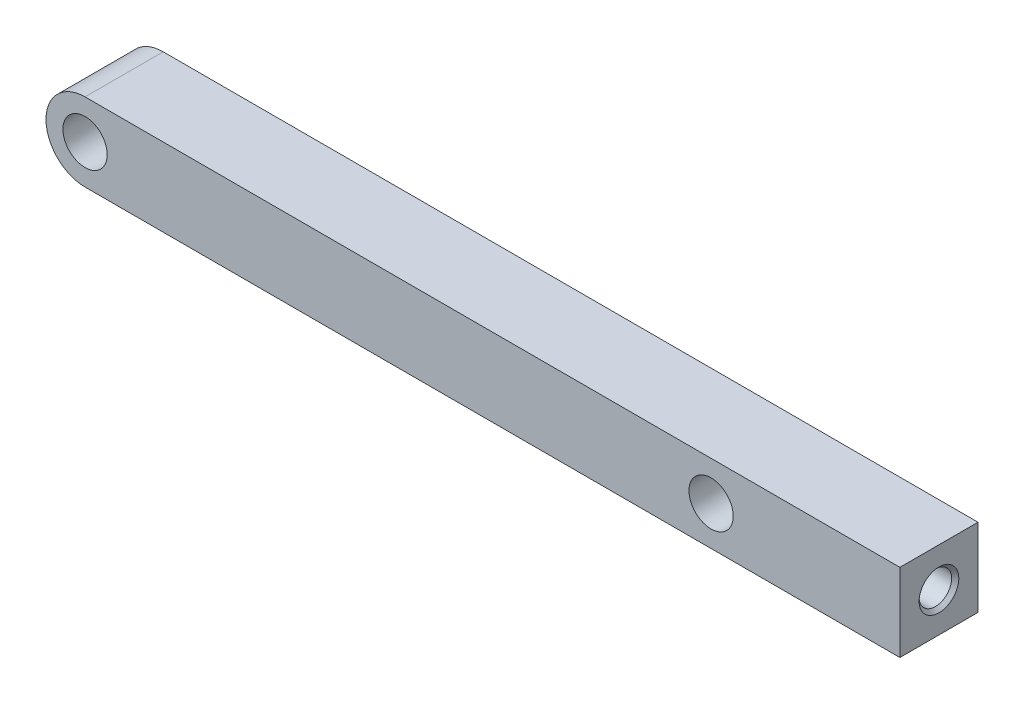
ISO-10303-21;
HEADER;
FILE_DESCRIPTION(('STEP AP214'),'2;1');
FILE_NAME('part.step','',(''),(''),'','','');
FILE_SCHEMA(('AUTOMOTIVE_DESIGN { 1 0 10303 214 1 1 1 1 }'));
ENDSEC;
DATA;
#1=APPLICATION_CONTEXT('core data for automotive mechanical design processes');
#2=APPLICATION_PROTOCOL_DEFINITION('international standard','automotive_design',2000,#1);
#3=PRODUCT_CONTEXT('',#1,'mechanical');
#4=PRODUCT('Part','Part','',(#3));
#5=PRODUCT_RELATED_PRODUCT_CATEGORY('part','',(#4));
#6=PRODUCT_DEFINITION_FORMATION('','',#4);
#7=PRODUCT_DEFINITION_CONTEXT('part definition',#1,'design');
#8=PRODUCT_DEFINITION('design','',#6,#7);
#9=PRODUCT_DEFINITION_SHAPE('','',#8);
#10=(LENGTH_UNIT() NAMED_UNIT(*) SI_UNIT(.MILLI.,.METRE.));
#11=(NAMED_UNIT(*) PLANE_ANGLE_UNIT() SI_UNIT($,.RADIAN.));
#12=(NAMED_UNIT(*) SI_UNIT($,.STERADIAN.) SOLID_ANGLE_UNIT());
#13=UNCERTAINTY_MEASURE_WITH_UNIT(LENGTH_MEASURE(1.E-05),#10,'distance_accuracy_value','');
#14=(GEOMETRIC_REPRESENTATION_CONTEXT(3) GLOBAL_UNCERTAINTY_ASSIGNED_CONTEXT((#13)) GLOBAL_UNIT_ASSIGNED_CONTEXT((#10,
#11,#12)) REPRESENTATION_CONTEXT('',''));
#15=CARTESIAN_POINT('',(0.,0.,0.));
#16=DIRECTION('',(0.,0.,1.));
#17=DIRECTION('',(1.,0.,0.));
#18=AXIS2_PLACEMENT_3D('',#15,#16,#17);
#19=CARTESIAN_POINT('',(0.,27.0416305603428,3.));
#20=DIRECTION('',(0.,-1.,0.));
#21=DIRECTION('',(1.,0.,0.));
#22=AXIS2_PLACEMENT_3D('',#19,#20,#21);
#23=PLANE('',#22);
#24=DIRECTION('',(-1.,0.,0.));
#25=VECTOR('',#24,1.);
#26=CARTESIAN_POINT('',(0.,27.0416305603428,-3.));
#27=LINE('',#26,#25);
#28=CARTESIAN_POINT('',(38.5416305603425,27.0416305603428,-3.));
#29=VERTEX_POINT('',#28);
#30=CARTESIAN_POINT('',(-24.0416305603425,27.0416305603427,-3.));
#31=VERTEX_POINT('',#30);
#32=EDGE_CURVE('E108',#29,#31,#27,.T.);
#33=ORIENTED_EDGE('',*,*,#32,.T.);
#34=DIRECTION('',(0.,0.,-1.));
#35=VECTOR('',#34,1.);
#36=CARTESIAN_POINT('',(-24.0416305603425,27.0416305603427,3.));
#37=LINE('',#36,#35);
#38=CARTESIAN_POINT('',(-24.0416305603425,27.0416305603427,3.));
#39=VERTEX_POINT('',#38);
#40=EDGE_CURVE('E11',#39,#31,#37,.T.);
#41=ORIENTED_EDGE('',*,*,#40,.F.);
#42=DIRECTION('',(-1.,0.,0.));
#43=VECTOR('',#42,1.);
#44=CARTESIAN_POINT('',(0.,27.0416305603428,3.));
#45=LINE('',#44,#43);
#46=CARTESIAN_POINT('',(38.5416305603425,27.0416305603428,3.));
#47=VERTEX_POINT('',#46);
#48=EDGE_CURVE('E119',#47,#39,#45,.T.);
#49=ORIENTED_EDGE('',*,*,#48,.F.);
#50=DIRECTION('',(0.,0.,-1.));
#51=VECTOR('',#50,1.);
#52=CARTESIAN_POINT('',(38.5416305603425,27.0416305603428,3.));
#53=LINE('',#52,#51);
#54=EDGE_CURVE('E131',#47,#29,#53,.T.);
#55=ORIENTED_EDGE('',*,*,#54,.T.);
#56=EDGE_LOOP('',(#33,#41,#49,#55));
#57=FACE_BOUND('',#56,.T.);
#58=ADVANCED_FACE('F47',(#57),#23,.F.);
#59=CARTESIAN_POINT('',(-24.0416305603425,24.0416305603427,3.));
#60=DIRECTION('',(0.,0.,-1.));
#61=DIRECTION('',(-1.,0.,0.));
#62=AXIS2_PLACEMENT_3D('',#59,#60,#61);
#63=CYLINDRICAL_SURFACE('',#62,3.);
#64=CARTESIAN_POINT('',(-24.0416305603425,24.0416305603427,-3.));
#65=DIRECTION('',(0.,0.,1.));
#66=DIRECTION('',(1.,0.,0.));
#67=AXIS2_PLACEMENT_3D('',#64,#65,#66);
#68=CIRCLE('',#67,3.);
#69=CARTESIAN_POINT('',(-24.0416305603425,21.0416305603427,-3.));
#70=VERTEX_POINT('',#69);
#71=EDGE_CURVE('E112',#31,#70,#68,.T.);
#72=ORIENTED_EDGE('',*,*,#71,.T.);
#73=DIRECTION('',(0.,0.,-1.));
#74=VECTOR('',#73,1.);
#75=CARTESIAN_POINT('',(-24.0416305603425,21.0416305603427,3.));
#76=LINE('',#75,#74);
#77=CARTESIAN_POINT('',(-24.0416305603425,21.0416305603427,3.));
#78=VERTEX_POINT('',#77);
#79=EDGE_CURVE('E55',#78,#70,#76,.T.);
#80=ORIENTED_EDGE('',*,*,#79,.F.);
#81=CARTESIAN_POINT('',(-24.0416305603425,24.0416305603427,3.));
#82=DIRECTION('',(0.,0.,1.));
#83=DIRECTION('',(1.,0.,0.));
#84=AXIS2_PLACEMENT_3D('',#81,#82,#83);
#85=CIRCLE('',#84,3.);
#86=EDGE_CURVE('E94',#39,#78,#85,.T.);
#87=ORIENTED_EDGE('',*,*,#86,.F.);
#88=ORIENTED_EDGE('',*,*,#40,.T.);
#89=EDGE_LOOP('',(#72,#80,#87,#88));
#90=FACE_BOUND('',#89,.T.);
#91=ADVANCED_FACE('F169',(#90),#63,.T.);
#92=CARTESIAN_POINT('',(0.,21.0416305603428,3.));
#93=DIRECTION('',(0.,1.,0.));
#94=DIRECTION('',(-1.,0.,0.));
#95=AXIS2_PLACEMENT_3D('',#92,#93,#94);
#96=PLANE('',#95);
#97=DIRECTION('',(1.,0.,0.));
#98=VECTOR('',#97,1.);
#99=CARTESIAN_POINT('',(0.,21.0416305603428,-3.));
#100=LINE('',#99,#98);
#101=CARTESIAN_POINT('',(38.5416305603425,21.0416305603428,-3.));
#102=VERTEX_POINT('',#101);
#103=EDGE_CURVE('E81',#70,#102,#100,.T.);
#104=ORIENTED_EDGE('',*,*,#103,.T.);
#105=DIRECTION('',(0.,0.,-1.));
#106=VECTOR('',#105,1.);
#107=CARTESIAN_POINT('',(38.5416305603425,21.0416305603428,3.));
#108=LINE('',#107,#106);
#109=CARTESIAN_POINT('',(38.5416305603425,21.0416305603428,3.));
#110=VERTEX_POINT('',#109);
#111=EDGE_CURVE('E142',#110,#102,#108,.T.);
#112=ORIENTED_EDGE('',*,*,#111,.F.);
#113=DIRECTION('',(1.,0.,0.));
#114=VECTOR('',#113,1.);
#115=CARTESIAN_POINT('',(0.,21.0416305603428,3.));
#116=LINE('',#115,#114);
#117=EDGE_CURVE('E123',#78,#110,#116,.T.);
#118=ORIENTED_EDGE('',*,*,#117,.F.);
#119=ORIENTED_EDGE('',*,*,#79,.T.);
#120=EDGE_LOOP('',(#104,#112,#118,#119));
#121=FACE_BOUND('',#120,.T.);
#122=ADVANCED_FACE('F144',(#121),#96,.F.);
#123=CARTESIAN_POINT('',(24.0416305603425,24.0416305603427,3.));
#124=DIRECTION('',(0.,0.,-1.));
#125=DIRECTION('',(-1.,0.,0.));
#126=AXIS2_PLACEMENT_3D('',#123,#124,#125);
#127=CYLINDRICAL_SURFACE('',#126,1.69999999999998);
#128=CARTESIAN_POINT('',(24.0416305603425,24.0416305603427,3.));
#129=DIRECTION('',(0.,0.,1.));
#130=DIRECTION('',(1.,0.,0.));
#131=AXIS2_PLACEMENT_3D('',#128,#129,#130);
#132=CIRCLE('',#131,1.69999999999998);
#133=CARTESIAN_POINT('',(25.7416305603425,24.0416305603427,3.));
#134=VERTEX_POINT('',#133);
#135=EDGE_CURVE('E126',#134,#134,#132,.T.);
#136=ORIENTED_EDGE('',*,*,#135,.T.);
#137=EDGE_LOOP('',(#136));
#138=FACE_BOUND('',#137,.T.);
#139=CARTESIAN_POINT('',(24.0416305603425,24.0416305603427,-3.));
#140=DIRECTION('',(0.,0.,1.));
#141=DIRECTION('',(1.,0.,0.));
#142=AXIS2_PLACEMENT_3D('',#139,#140,#141);
#143=CIRCLE('',#142,1.69999999999998);
#144=CARTESIAN_POINT('',(25.7416305603425,24.0416305603427,-3.));
#145=VERTEX_POINT('',#144);
#146=EDGE_CURVE('E136',#145,#145,#143,.T.);
#147=ORIENTED_EDGE('',*,*,#146,.F.);
#148=EDGE_LOOP('',(#147));
#149=FACE_BOUND('',#148,.T.);
#150=ADVANCED_FACE('F154',(#138,#149),#127,.F.);
#151=CARTESIAN_POINT('',(38.5416305603425,0.,3.));
#152=DIRECTION('',(-1.,0.,0.));
#153=DIRECTION('',(0.,0.,1.));
#154=AXIS2_PLACEMENT_3D('',#151,#152,#153);
#155=PLANE('',#154);
#156=CARTESIAN_POINT('',(38.5416305603425,24.0416305603428,0.));
#157=DIRECTION('',(1.,0.,0.));
#158=DIRECTION('',(0.,0.,-1.));
#159=AXIS2_PLACEMENT_3D('',#156,#157,#158);
#160=CIRCLE('',#159,1.525);
#161=CARTESIAN_POINT('',(38.5416305603425,24.0416305603428,-1.525));
#162=VERTEX_POINT('',#161);
#163=EDGE_CURVE('E115',#162,#162,#160,.T.);
#164=ORIENTED_EDGE('',*,*,#163,.F.);
#165=EDGE_LOOP('',(#164));
#166=FACE_BOUND('',#165,.T.);
#167=DIRECTION('',(0.,1.,0.));
#168=VECTOR('',#167,1.);
#169=CARTESIAN_POINT('',(38.5416305603425,0.,-3.));
#170=LINE('',#169,#168);
#171=EDGE_CURVE('E87',#102,#29,#170,.T.);
#172=ORIENTED_EDGE('',*,*,#171,.T.);
#173=ORIENTED_EDGE('',*,*,#54,.F.);
#174=DIRECTION('',(0.,1.,0.));
#175=VECTOR('',#174,1.);
#176=CARTESIAN_POINT('',(38.5416305603425,0.,3.));
#177=LINE('',#176,#175);
#178=EDGE_CURVE('E63',#110,#47,#177,.T.);
#179=ORIENTED_EDGE('',*,*,#178,.F.);
#180=ORIENTED_EDGE('',*,*,#111,.T.);
#181=EDGE_LOOP('',(#172,#173,#179,#180));
#182=FACE_BOUND('',#181,.T.);
#183=ADVANCED_FACE('F151',(#166,#182),#155,.F.);
#184=CARTESIAN_POINT('',(-24.0416305603425,24.0416305603427,3.));
#185=DIRECTION('',(0.,0.,-1.));
#186=DIRECTION('',(-1.,0.,0.));
#187=AXIS2_PLACEMENT_3D('',#184,#185,#186);
#188=CYLINDRICAL_SURFACE('',#187,1.69999999999999);
#189=CARTESIAN_POINT('',(-24.0416305603425,24.0416305603427,3.));
#190=DIRECTION('',(0.,0.,1.));
#191=DIRECTION('',(1.,0.,0.));
#192=AXIS2_PLACEMENT_3D('',#189,#190,#191);
#193=CIRCLE('',#192,1.69999999999999);
#194=CARTESIAN_POINT('',(-22.3416305603425,24.0416305603427,3.));
#195=VERTEX_POINT('',#194);
#196=EDGE_CURVE('E129',#195,#195,#193,.T.);
#197=ORIENTED_EDGE('',*,*,#196,.T.);
#198=EDGE_LOOP('',(#197));
#199=FACE_BOUND('',#198,.T.);
#200=CARTESIAN_POINT('',(-24.0416305603425,24.0416305603427,-3.));
#201=DIRECTION('',(0.,0.,1.));
#202=DIRECTION('',(1.,0.,0.));
#203=AXIS2_PLACEMENT_3D('',#200,#201,#202);
#204=CIRCLE('',#203,1.69999999999999);
#205=CARTESIAN_POINT('',(-22.3416305603425,24.0416305603427,-3.));
#206=VERTEX_POINT('',#205);
#207=EDGE_CURVE('E121',#206,#206,#204,.T.);
#208=ORIENTED_EDGE('',*,*,#207,.F.);
#209=EDGE_LOOP('',(#208));
#210=FACE_BOUND('',#209,.T.);
#211=ADVANCED_FACE('F153',(#199,#210),#188,.F.);
#212=CARTESIAN_POINT('',(0.,0.,3.));
#213=DIRECTION('',(0.,0.,1.));
#214=DIRECTION('',(1.,0.,0.));
#215=AXIS2_PLACEMENT_3D('',#212,#213,#214);
#216=PLANE('',#215);
#217=ORIENTED_EDGE('',*,*,#48,.T.);
#218=ORIENTED_EDGE('',*,*,#86,.T.);
#219=ORIENTED_EDGE('',*,*,#117,.T.);
#220=ORIENTED_EDGE('',*,*,#178,.T.);
#221=EDGE_LOOP('',(#217,#218,#219,#220));
#222=FACE_BOUND('',#221,.T.);
#223=ORIENTED_EDGE('',*,*,#135,.F.);
#224=EDGE_LOOP('',(#223));
#225=FACE_BOUND('',#224,.T.);
#226=ORIENTED_EDGE('',*,*,#196,.F.);
#227=EDGE_LOOP('',(#226));
#228=FACE_BOUND('',#227,.T.);
#229=ADVANCED_FACE('F161',(#222,#225,#228),#216,.T.);
#230=CARTESIAN_POINT('',(0.,0.,-3.));
#231=DIRECTION('',(0.,0.,1.));
#232=DIRECTION('',(1.,0.,0.));
#233=AXIS2_PLACEMENT_3D('',#230,#231,#232);
#234=PLANE('',#233);
#235=ORIENTED_EDGE('',*,*,#32,.F.);
#236=ORIENTED_EDGE('',*,*,#171,.F.);
#237=ORIENTED_EDGE('',*,*,#103,.F.);
#238=ORIENTED_EDGE('',*,*,#71,.F.);
#239=EDGE_LOOP('',(#235,#236,#237,#238));
#240=FACE_BOUND('',#239,.T.);
#241=ORIENTED_EDGE('',*,*,#146,.T.);
#242=EDGE_LOOP('',(#241));
#243=FACE_BOUND('',#242,.T.);
#244=ORIENTED_EDGE('',*,*,#207,.T.);
#245=EDGE_LOOP('',(#244));
#246=FACE_BOUND('',#245,.T.);
#247=ADVANCED_FACE('F102',(#240,#243,#246),#234,.F.);
#248=CARTESIAN_POINT('',(31.7927063341269,24.0416305603428,0.));
#249=DIRECTION('',(1.,0.,0.));
#250=DIRECTION('',(0.,0.,-1.));
#251=AXIS2_PLACEMENT_3D('',#248,#249,#250);
#252=CONICAL_SURFACE('',#251,1.25,1.02974425867665);
#253=CARTESIAN_POINT('',(31.0416305603425,24.0416305603428,0.));
#254=VERTEX_POINT('',#253);
#255=VERTEX_LOOP('',#254);
#256=FACE_BOUND('',#255,.T.);
#257=CARTESIAN_POINT('',(31.7927063341269,24.0416305603428,0.));
#258=DIRECTION('',(1.,0.,0.));
#259=DIRECTION('',(0.,0.,-1.));
#260=AXIS2_PLACEMENT_3D('',#257,#258,#259);
#261=CIRCLE('',#260,1.25);
#262=CARTESIAN_POINT('',(31.7927063341269,24.0416305603428,-1.25));
#263=VERTEX_POINT('',#262);
#264=EDGE_CURVE('E106',#263,#263,#261,.T.);
#265=ORIENTED_EDGE('',*,*,#264,.T.);
#266=EDGE_LOOP('',(#265));
#267=FACE_BOUND('',#266,.T.);
#268=ADVANCED_FACE('F98',(#256,#267),#252,.F.);
#269=CARTESIAN_POINT('',(38.5416305603425,24.0416305603428,0.));
#270=DIRECTION('',(1.,0.,0.));
#271=DIRECTION('',(0.,0.,-1.));
#272=AXIS2_PLACEMENT_3D('',#269,#270,#271);
#273=CYLINDRICAL_SURFACE('',#272,1.24999999999999);
#274=ORIENTED_EDGE('',*,*,#264,.F.);
#275=EDGE_LOOP('',(#274));
#276=FACE_BOUND('',#275,.T.);
#277=CARTESIAN_POINT('',(38.2666305603425,24.0416305603428,0.));
#278=DIRECTION('',(1.,0.,0.));
#279=DIRECTION('',(0.,0.,-1.));
#280=AXIS2_PLACEMENT_3D('',#277,#278,#279);
#281=CIRCLE('',#280,1.24999999999999);
#282=CARTESIAN_POINT('',(38.2666305603425,24.0416305603428,-1.24999999999999));
#283=VERTEX_POINT('',#282);
#284=EDGE_CURVE('E109',#283,#283,#281,.T.);
#285=ORIENTED_EDGE('',*,*,#284,.T.);
#286=EDGE_LOOP('',(#285));
#287=FACE_BOUND('',#286,.T.);
#288=ADVANCED_FACE('F101',(#276,#287),#273,.F.);
#289=CARTESIAN_POINT('',(38.5416305603425,24.0416305603428,0.));
#290=DIRECTION('',(1.,0.,0.));
#291=DIRECTION('',(0.,0.,-1.));
#292=AXIS2_PLACEMENT_3D('',#289,#290,#291);
#293=CONICAL_SURFACE('',#292,1.525,0.785398163397474);
#294=ORIENTED_EDGE('',*,*,#284,.F.);
#295=EDGE_LOOP('',(#294));
#296=FACE_BOUND('',#295,.T.);
#297=ORIENTED_EDGE('',*,*,#163,.T.);
#298=EDGE_LOOP('',(#297));
#299=FACE_BOUND('',#298,.T.);
#300=ADVANCED_FACE('F235',(#296,#299),#293,.F.);
#301=CLOSED_SHELL('',(#58,#91,#122,#150,#183,#211,#229,#247,#268,#288,#300));
#302=MANIFOLD_SOLID_BREP('B2',#301);
#303=ADVANCED_BREP_SHAPE_REPRESENTATION('',(#18,#302),#14);
#304=SHAPE_DEFINITION_REPRESENTATION(#9,#303);
ENDSEC;
END-ISO-10303-21;
